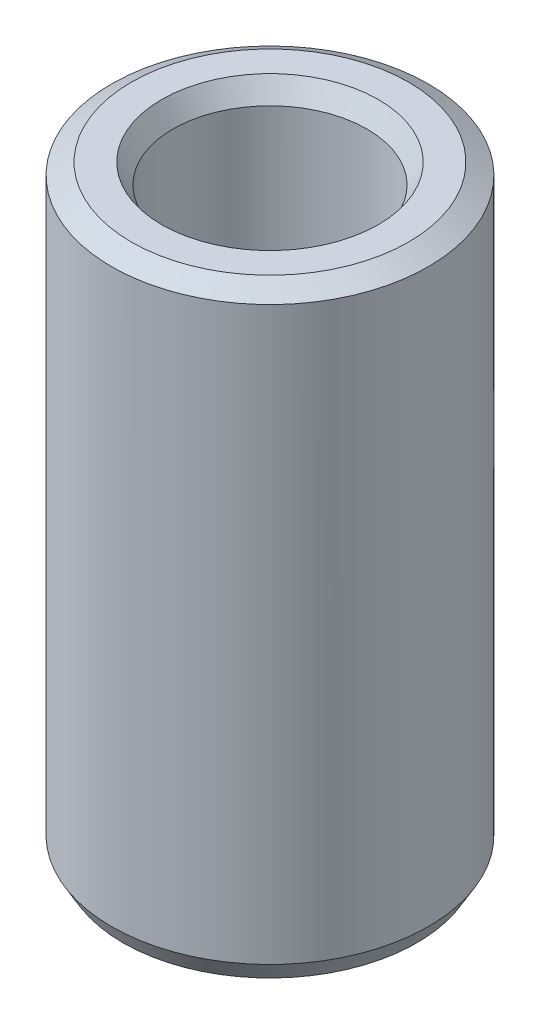
ISO-10303-21;
HEADER;
FILE_DESCRIPTION(('STEP AP214'),'2;1');
FILE_NAME('part.step','',(''),(''),'','','');
FILE_SCHEMA(('AUTOMOTIVE_DESIGN { 1 0 10303 214 1 1 1 1 }'));
ENDSEC;
DATA;
#1=APPLICATION_CONTEXT('core data for automotive mechanical design processes');
#2=APPLICATION_PROTOCOL_DEFINITION('international standard','automotive_design',2000,#1);
#3=PRODUCT_CONTEXT('',#1,'mechanical');
#4=PRODUCT('Part','Part','',(#3));
#5=PRODUCT_RELATED_PRODUCT_CATEGORY('part','',(#4));
#6=PRODUCT_DEFINITION_FORMATION('','',#4);
#7=PRODUCT_DEFINITION_CONTEXT('part definition',#1,'design');
#8=PRODUCT_DEFINITION('design','',#6,#7);
#9=PRODUCT_DEFINITION_SHAPE('','',#8);
#10=(LENGTH_UNIT() NAMED_UNIT(*) SI_UNIT(.MILLI.,.METRE.));
#11=(NAMED_UNIT(*) PLANE_ANGLE_UNIT() SI_UNIT($,.RADIAN.));
#12=(NAMED_UNIT(*) SI_UNIT($,.STERADIAN.) SOLID_ANGLE_UNIT());
#13=UNCERTAINTY_MEASURE_WITH_UNIT(LENGTH_MEASURE(1.E-05),#10,'distance_accuracy_value','');
#14=(GEOMETRIC_REPRESENTATION_CONTEXT(3) GLOBAL_UNCERTAINTY_ASSIGNED_CONTEXT((#13)) GLOBAL_UNIT_ASSIGNED_CONTEXT((#10,
#11,#12)) REPRESENTATION_CONTEXT('',''));
#15=CARTESIAN_POINT('',(0.,0.,0.));
#16=DIRECTION('',(0.,0.,1.));
#17=DIRECTION('',(1.,0.,0.));
#18=AXIS2_PLACEMENT_3D('',#15,#16,#17);
#19=CARTESIAN_POINT('',(0.,133.217558853495,0.));
#20=DIRECTION('',(0.,-1.,0.));
#21=DIRECTION('',(0.,0.,-1.));
#22=AXIS2_PLACEMENT_3D('',#19,#20,#21);
#23=CYLINDRICAL_SURFACE('',#22,35.);
#24=CARTESIAN_POINT('',(0.,4.37569457591963,0.));
#25=DIRECTION('',(0.,1.,0.));
#26=DIRECTION('',(0.,0.,1.));
#27=AXIS2_PLACEMENT_3D('',#24,#25,#26);
#28=CIRCLE('',#27,35.);
#29=CARTESIAN_POINT('',(0.,4.37569457591963,35.));
#30=VERTEX_POINT('',#29);
#31=EDGE_CURVE('E10',#30,#30,#28,.T.);
#32=ORIENTED_EDGE('',*,*,#31,.T.);
#33=EDGE_LOOP('',(#32));
#34=FACE_BOUND('',#33,.T.);
#35=CARTESIAN_POINT('',(0.,130.691250412197,0.));
#36=DIRECTION('',(0.,1.,0.));
#37=DIRECTION('',(0.,0.,1.));
#38=AXIS2_PLACEMENT_3D('',#35,#36,#37);
#39=CIRCLE('',#38,35.);
#40=CARTESIAN_POINT('',(0.,130.691250412197,-35.));
#41=VERTEX_POINT('',#40);
#42=EDGE_CURVE('E50',#41,#41,#39,.F.);
#43=ORIENTED_EDGE('',*,*,#42,.T.);
#44=EDGE_LOOP('',(#43));
#45=FACE_BOUND('',#44,.T.);
#46=ADVANCED_FACE('F39',(#34,#45),#23,.T.);
#47=CARTESIAN_POINT('',(0.,133.217558853495,0.));
#48=DIRECTION('',(0.,1.,0.));
#49=DIRECTION('',(0.,0.,1.));
#50=AXIS2_PLACEMENT_3D('',#47,#48,#49);
#51=PLANE('',#50);
#52=CARTESIAN_POINT('',(0.,133.217558853495,0.));
#53=DIRECTION('',(0.,1.,0.));
#54=DIRECTION('',(0.,0.,1.));
#55=AXIS2_PLACEMENT_3D('',#52,#53,#54);
#56=CIRCLE('',#55,23.9561905738797);
#57=CARTESIAN_POINT('',(0.,133.217558853495,23.9561905738797));
#58=VERTEX_POINT('',#57);
#59=EDGE_CURVE('E58',#58,#58,#56,.F.);
#60=ORIENTED_EDGE('',*,*,#59,.T.);
#61=EDGE_LOOP('',(#60));
#62=FACE_BOUND('',#61,.T.);
#63=CARTESIAN_POINT('',(0.,133.217558853495,0.));
#64=DIRECTION('',(0.,1.,0.));
#65=DIRECTION('',(0.,0.,1.));
#66=AXIS2_PLACEMENT_3D('',#63,#64,#65);
#67=CIRCLE('',#66,30.6243054240803);
#68=CARTESIAN_POINT('',(0.,133.217558853495,-30.6243054240803));
#69=VERTEX_POINT('',#68);
#70=EDGE_CURVE('E61',#69,#69,#67,.T.);
#71=ORIENTED_EDGE('',*,*,#70,.T.);
#72=EDGE_LOOP('',(#71));
#73=FACE_BOUND('',#72,.T.);
#74=ADVANCED_FACE('F88',(#62,#73),#51,.T.);
#75=CARTESIAN_POINT('',(0.,0.,0.));
#76=DIRECTION('',(0.,1.,0.));
#77=DIRECTION('',(0.,0.,1.));
#78=AXIS2_PLACEMENT_3D('',#75,#76,#77);
#79=PLANE('',#78);
#80=CARTESIAN_POINT('',(0.,0.,0.));
#81=DIRECTION('',(0.,1.,0.));
#82=DIRECTION('',(0.,0.,1.));
#83=AXIS2_PLACEMENT_3D('',#80,#81,#82);
#84=CIRCLE('',#83,25.8055767085005);
#85=CARTESIAN_POINT('',(0.,0.,-25.8055767085005));
#86=VERTEX_POINT('',#85);
#87=EDGE_CURVE('E51',#86,#86,#84,.T.);
#88=ORIENTED_EDGE('',*,*,#87,.T.);
#89=EDGE_LOOP('',(#88));
#90=FACE_BOUND('',#89,.T.);
#91=CARTESIAN_POINT('',(0.,0.,0.));
#92=DIRECTION('',(0.,1.,0.));
#93=DIRECTION('',(0.,0.,1.));
#94=AXIS2_PLACEMENT_3D('',#91,#92,#93);
#95=CIRCLE('',#94,32.4736915587012);
#96=CARTESIAN_POINT('',(0.,0.,32.4736915587012));
#97=VERTEX_POINT('',#96);
#98=EDGE_CURVE('E54',#97,#97,#95,.F.);
#99=ORIENTED_EDGE('',*,*,#98,.T.);
#100=EDGE_LOOP('',(#99));
#101=FACE_BOUND('',#100,.T.);
#102=ADVANCED_FACE('F83',(#90,#101),#79,.F.);
#103=CARTESIAN_POINT('',(0.,133.217558853495,0.));
#104=DIRECTION('',(0.,-1.,0.));
#105=DIRECTION('',(0.,0.,-1.));
#106=AXIS2_PLACEMENT_3D('',#103,#104,#105);
#107=CYLINDRICAL_SURFACE('',#106,21.4298821325809);
#108=CARTESIAN_POINT('',(0.,128.841864277576,0.));
#109=DIRECTION('',(0.,1.,0.));
#110=DIRECTION('',(0.,0.,1.));
#111=AXIS2_PLACEMENT_3D('',#108,#109,#110);
#112=CIRCLE('',#111,21.4298821325809);
#113=CARTESIAN_POINT('',(0.,128.841864277576,21.4298821325809));
#114=VERTEX_POINT('',#113);
#115=EDGE_CURVE('E67',#114,#114,#112,.T.);
#116=ORIENTED_EDGE('',*,*,#115,.T.);
#117=EDGE_LOOP('',(#116));
#118=FACE_BOUND('',#117,.T.);
#119=CARTESIAN_POINT('',(0.,2.52630844129884,0.));
#120=DIRECTION('',(0.,1.,0.));
#121=DIRECTION('',(0.,0.,1.));
#122=AXIS2_PLACEMENT_3D('',#119,#120,#121);
#123=CIRCLE('',#122,21.4298821325809);
#124=CARTESIAN_POINT('',(0.,2.52630844129884,-21.4298821325809));
#125=VERTEX_POINT('',#124);
#126=EDGE_CURVE('E69',#125,#125,#123,.F.);
#127=ORIENTED_EDGE('',*,*,#126,.T.);
#128=EDGE_LOOP('',(#127));
#129=FACE_BOUND('',#128,.T.);
#130=ADVANCED_FACE('F71',(#118,#129),#107,.F.);
#131=CARTESIAN_POINT('',(0.,128.841864277576,0.));
#132=DIRECTION('',(0.,1.,0.));
#133=DIRECTION('',(0.,0.,1.));
#134=AXIS2_PLACEMENT_3D('',#131,#132,#133);
#135=CONICAL_SURFACE('',#134,21.4298821325809,0.5235987755983);
#136=ORIENTED_EDGE('',*,*,#59,.F.);
#137=EDGE_LOOP('',(#136));
#138=FACE_BOUND('',#137,.T.);
#139=ORIENTED_EDGE('',*,*,#115,.F.);
#140=EDGE_LOOP('',(#139));
#141=FACE_BOUND('',#140,.T.);
#142=ADVANCED_FACE('F77',(#138,#141),#135,.F.);
#143=CARTESIAN_POINT('',(0.,0.,0.));
#144=DIRECTION('',(0.,-1.,0.));
#145=DIRECTION('',(0.,0.,-1.));
#146=AXIS2_PLACEMENT_3D('',#143,#144,#145);
#147=CONICAL_SURFACE('',#146,25.8055767085005,1.04719755119659);
#148=CARTESIAN_POINT('',(0.,2.52630844129884,-21.4298821325809));
#149=CARTESIAN_POINT('',(0.,2.49999272836864,-21.4754622844134));
#150=CARTESIAN_POINT('',(0.,2.47367701543844,-21.5210424362459));
#151=CARTESIAN_POINT('',(0.,2.42104558957805,-21.6122027399109));
#152=CARTESIAN_POINT('',(0.,2.39472987664785,-21.6577828917434));
#153=CARTESIAN_POINT('',(0.,2.34209845078746,-21.7489431954083));
#154=CARTESIAN_POINT('',(0.,2.31578273785727,-21.7945233472408));
#155=CARTESIAN_POINT('',(0.,2.26315131199687,-21.8856836509058));
#156=CARTESIAN_POINT('',(0.,2.23683559906668,-21.9312638027383));
#157=CARTESIAN_POINT('',(0.,2.18420417320628,-22.0224241064033));
#158=CARTESIAN_POINT('',(0.,2.15788846027609,-22.0680042582358));
#159=CARTESIAN_POINT('',(0.,2.1052570344157,-22.1591645619008));
#160=CARTESIAN_POINT('',(0.,2.0789413214855,-22.2047447137333));
#161=CARTESIAN_POINT('',(0.,2.02630989562511,-22.2959050173983));
#162=CARTESIAN_POINT('',(0.,1.99999418269491,-22.3414851692308));
#163=CARTESIAN_POINT('',(0.,1.94736275683452,-22.4326454728958));
#164=CARTESIAN_POINT('',(0.,1.92104704390432,-22.4782256247283));
#165=CARTESIAN_POINT('',(0.,1.86841561804393,-22.5693859283933));
#166=CARTESIAN_POINT('',(0.,1.84209990511373,-22.6149660802258));
#167=CARTESIAN_POINT('',(0.,1.78946847925334,-22.7061263838908));
#168=CARTESIAN_POINT('',(0.,1.76315276632315,-22.7517065357233));
#169=CARTESIAN_POINT('',(0.,1.71052134046275,-22.8428668393883));
#170=CARTESIAN_POINT('',(0.,1.68420562753256,-22.8884469912208));
#171=CARTESIAN_POINT('',(0.,1.63157420167216,-22.9796072948857));
#172=CARTESIAN_POINT('',(0.,1.60525848874197,-23.0251874467182));
#173=CARTESIAN_POINT('',(0.,1.55262706288158,-23.1163477503832));
#174=CARTESIAN_POINT('',(0.,1.52631134995138,-23.1619279022157));
#175=CARTESIAN_POINT('',(0.,1.47367992409099,-23.2530882058807));
#176=CARTESIAN_POINT('',(0.,1.44736421116079,-23.2986683577132));
#177=CARTESIAN_POINT('',(0.,1.3947327853004,-23.3898286613782));
#178=CARTESIAN_POINT('',(0.,1.3684170723702,-23.4354088132107));
#179=CARTESIAN_POINT('',(0.,1.31578564650981,-23.5265691168757));
#180=CARTESIAN_POINT('',(0.,1.28946993357961,-23.5721492687082));
#181=CARTESIAN_POINT('',(0.,1.23683850771922,-23.6633095723732));
#182=CARTESIAN_POINT('',(0.,1.21052279478902,-23.7088897242057));
#183=CARTESIAN_POINT('',(0.,1.15789136892863,-23.8000500278707));
#184=CARTESIAN_POINT('',(0.,1.13157565599844,-23.8456301797032));
#185=CARTESIAN_POINT('',(0.,1.07894423013804,-23.9367904833682));
#186=CARTESIAN_POINT('',(0.,1.05262851720785,-23.9823706352007));
#187=CARTESIAN_POINT('',(0.,0.999997091347455,-24.0735309388657));
#188=CARTESIAN_POINT('',(0.,0.973681378417259,-24.1191110906982));
#189=CARTESIAN_POINT('',(0.,0.921049952556867,-24.2102713943631));
#190=CARTESIAN_POINT('',(0.,0.894734239626671,-24.2558515461956));
#191=CARTESIAN_POINT('',(0.,0.842102813766279,-24.3470118498606));
#192=CARTESIAN_POINT('',(0.,0.815787100836082,-24.3925920016931));
#193=CARTESIAN_POINT('',(0.,0.76315567497569,-24.4837523053581));
#194=CARTESIAN_POINT('',(0.,0.736839962045494,-24.5293324571906));
#195=CARTESIAN_POINT('',(0.,0.684208536185101,-24.6204927608556));
#196=CARTESIAN_POINT('',(0.,0.657892823254905,-24.6660729126881));
#197=CARTESIAN_POINT('',(0.,0.605261397394513,-24.7572332163531));
#198=CARTESIAN_POINT('',(0.,0.578945684464316,-24.8028133681856));
#199=CARTESIAN_POINT('',(0.,0.526314258603924,-24.8939736718506));
#200=CARTESIAN_POINT('',(0.,0.499998545673728,-24.9395538236831));
#201=CARTESIAN_POINT('',(0.,0.447367119813336,-25.0307141273481));
#202=CARTESIAN_POINT('',(0.,0.42105140688314,-25.0762942791806));
#203=CARTESIAN_POINT('',(0.,0.368419981022747,-25.1674545828456));
#204=CARTESIAN_POINT('',(0.,0.34210426809255,-25.2130347346781));
#205=CARTESIAN_POINT('',(0.,0.289472842232158,-25.3041950383431));
#206=CARTESIAN_POINT('',(0.,0.263157129301962,-25.3497751901756));
#207=CARTESIAN_POINT('',(0.,0.21052570344157,-25.4409354938405));
#208=CARTESIAN_POINT('',(0.,0.184209990511374,-25.486515645673));
#209=CARTESIAN_POINT('',(0.,0.131578564650981,-25.577675949338));
#210=CARTESIAN_POINT('',(0.,0.105262851720785,-25.6232561011705));
#211=CARTESIAN_POINT('',(0.,0.0526314258603919,-25.7144164048355));
#212=CARTESIAN_POINT('',(0.,0.0263157129301955,-25.759996556668));
#213=CARTESIAN_POINT('',(0.,0.,-25.8055767085005));
#214=B_SPLINE_CURVE_WITH_KNOTS('',3,(#148,#149,#150,#151,#152,#153,#154,#155,#156,#157,#158,
#159,#160,#161,#162,#163,#164,#165,#166,#167,#168,#169,#170,#171,#172,#173,#174,#175,#176,#177,
#178,#179,#180,#181,#182,#183,#184,#185,#186,#187,#188,#189,#190,#191,#192,#193,#194,#195,#196,
#197,#198,#199,#200,#201,#202,#203,#204,#205,#206,#207,#208,#209,#210,#211,#212,#213),
.UNSPECIFIED.,.F.,.F.,(4,2,2,2,2,2,2,2,2,2,2,2,2,2,2,2,2,2,2,2,2,2,2,2,2,2,2,2,2,2,2,2,4),(0.,
0.157894277581176,0.31578855516235,0.473682832743526,0.631577110324702,0.789471387905876,
0.947365665487052,1.10525994306823,1.2631542206494,1.42104849823058,1.57894277581175,
1.73683705339293,1.8947313309741,2.05262560855528,2.21051988613645,2.36841416371763,
2.52630844129881,2.68420271887998,2.84209699646116,2.99999127404233,3.15788555162351,
3.31577982920468,3.47367410678586,3.63156838436703,3.78946266194821,3.94735693952938,
4.10525121711056,4.26314549469173,4.42103977227291,4.57893404985408,4.73682832743526,
4.89472260501643,5.05261688259761),.UNSPECIFIED.);
#215=EDGE_CURVE('BSEAM73',#125,#86,#214,.T.);
#216=ORIENTED_EDGE('',*,*,#126,.F.);
#217=ORIENTED_EDGE('',*,*,#87,.F.);
#218=ORIENTED_EDGE('',*,*,#215,.T.);
#219=ORIENTED_EDGE('',*,*,#215,.F.);
#220=EDGE_LOOP('',(#216,#218,#217,#219));
#221=FACE_BOUND('',#220,.T.);
#222=ADVANCED_FACE('F73',(#221),#147,.F.);
#223=CARTESIAN_POINT('',(0.,4.37569457591963,0.));
#224=DIRECTION('',(0.,1.,0.));
#225=DIRECTION('',(0.,0.,1.));
#226=AXIS2_PLACEMENT_3D('',#223,#224,#225);
#227=CONICAL_SURFACE('',#226,35.,0.523598775598299);
#228=ORIENTED_EDGE('',*,*,#98,.F.);
#229=EDGE_LOOP('',(#228));
#230=FACE_BOUND('',#229,.T.);
#231=ORIENTED_EDGE('',*,*,#31,.F.);
#232=EDGE_LOOP('',(#231));
#233=FACE_BOUND('',#232,.T.);
#234=ADVANCED_FACE('F76',(#230,#233),#227,.T.);
#235=CARTESIAN_POINT('',(0.,133.217558853495,0.));
#236=DIRECTION('',(0.,-1.,0.));
#237=DIRECTION('',(0.,0.,-1.));
#238=AXIS2_PLACEMENT_3D('',#235,#236,#237);
#239=CONICAL_SURFACE('',#238,30.6243054240803,1.0471975511966);
#240=CARTESIAN_POINT('',(0.,130.691250412197,-35.));
#241=CARTESIAN_POINT('',(0.,130.717566125127,-34.9544198481675));
#242=CARTESIAN_POINT('',(0.,130.743881838057,-34.908839696335));
#243=CARTESIAN_POINT('',(0.,130.796513263917,-34.81767939267));
#244=CARTESIAN_POINT('',(0.,130.822828976848,-34.7720992408376));
#245=CARTESIAN_POINT('',(0.,130.875460402708,-34.6809389371726));
#246=CARTESIAN_POINT('',(0.,130.901776115638,-34.6353587853401));
#247=CARTESIAN_POINT('',(0.,130.954407541499,-34.5441984816751));
#248=CARTESIAN_POINT('',(0.,130.980723254429,-34.4986183298426));
#249=CARTESIAN_POINT('',(0.,131.033354680289,-34.4074580261776));
#250=CARTESIAN_POINT('',(0.,131.059670393219,-34.3618778743451));
#251=CARTESIAN_POINT('',(0.,131.11230181908,-34.2707175706801));
#252=CARTESIAN_POINT('',(0.,131.13861753201,-34.2251374188476));
#253=CARTESIAN_POINT('',(0.,131.19124895787,-34.1339771151826));
#254=CARTESIAN_POINT('',(0.,131.217564670801,-34.0883969633501));
#255=CARTESIAN_POINT('',(0.,131.270196096661,-33.9972366596851));
#256=CARTESIAN_POINT('',(0.,131.296511809591,-33.9516565078526));
#257=CARTESIAN_POINT('',(0.,131.349143235451,-33.8604962041876));
#258=CARTESIAN_POINT('',(0.,131.375458948382,-33.8149160523551));
#259=CARTESIAN_POINT('',(0.,131.428090374242,-33.7237557486901));
#260=CARTESIAN_POINT('',(0.,131.454406087172,-33.6781755968576));
#261=CARTESIAN_POINT('',(0.,131.507037513033,-33.5870152931926));
#262=CARTESIAN_POINT('',(0.,131.533353225963,-33.5414351413601));
#263=CARTESIAN_POINT('',(0.,131.585984651823,-33.4502748376951));
#264=CARTESIAN_POINT('',(0.,131.612300364753,-33.4046946858626));
#265=CARTESIAN_POINT('',(0.,131.664931790614,-33.3135343821977));
#266=CARTESIAN_POINT('',(0.,131.691247503544,-33.2679542303652));
#267=CARTESIAN_POINT('',(0.,131.743878929404,-33.1767939267002));
#268=CARTESIAN_POINT('',(0.,131.770194642335,-33.1312137748677));
#269=CARTESIAN_POINT('',(0.,131.822826068195,-33.0400534712027));
#270=CARTESIAN_POINT('',(0.,131.849141781125,-32.9944733193702));
#271=CARTESIAN_POINT('',(0.,131.901773206986,-32.9033130157052));
#272=CARTESIAN_POINT('',(0.,131.928088919916,-32.8577328638727));
#273=CARTESIAN_POINT('',(0.,131.980720345776,-32.7665725602077));
#274=CARTESIAN_POINT('',(0.,132.007036058706,-32.7209924083752));
#275=CARTESIAN_POINT('',(0.,132.059667484567,-32.6298321047102));
#276=CARTESIAN_POINT('',(0.,132.085983197497,-32.5842519528777));
#277=CARTESIAN_POINT('',(0.,132.138614623357,-32.4930916492127));
#278=CARTESIAN_POINT('',(0.,132.164930336288,-32.4475114973802));
#279=CARTESIAN_POINT('',(0.,132.217561762148,-32.3563511937152));
#280=CARTESIAN_POINT('',(0.,132.243877475078,-32.3107710418827));
#281=CARTESIAN_POINT('',(0.,132.296508900939,-32.2196107382177));
#282=CARTESIAN_POINT('',(0.,132.322824613869,-32.1740305863852));
#283=CARTESIAN_POINT('',(0.,132.375456039729,-32.0828702827202));
#284=CARTESIAN_POINT('',(0.,132.401771752659,-32.0372901308877));
#285=CARTESIAN_POINT('',(0.,132.45440317852,-31.9461298272228));
#286=CARTESIAN_POINT('',(0.,132.48071889145,-31.9005496753903));
#287=CARTESIAN_POINT('',(0.,132.53335031731,-31.8093893717253));
#288=CARTESIAN_POINT('',(0.,132.559666030241,-31.7638092198928));
#289=CARTESIAN_POINT('',(0.,132.612297456101,-31.6726489162278));
#290=CARTESIAN_POINT('',(0.,132.638613169031,-31.6270687643953));
#291=CARTESIAN_POINT('',(0.,132.691244594892,-31.5359084607303));
#292=CARTESIAN_POINT('',(0.,132.717560307822,-31.4903283088978));
#293=CARTESIAN_POINT('',(0.,132.770191733682,-31.3991680052328));
#294=CARTESIAN_POINT('',(0.,132.796507446612,-31.3535878534003));
#295=CARTESIAN_POINT('',(0.,132.849138872473,-31.2624275497353));
#296=CARTESIAN_POINT('',(0.,132.875454585403,-31.2168473979028));
#297=CARTESIAN_POINT('',(0.,132.928086011263,-31.1256870942378));
#298=CARTESIAN_POINT('',(0.,132.954401724193,-31.0801069424053));
#299=CARTESIAN_POINT('',(0.,133.007033150054,-30.9889466387403));
#300=CARTESIAN_POINT('',(0.,133.033348862984,-30.9433664869078));
#301=CARTESIAN_POINT('',(0.,133.085980288844,-30.8522061832428));
#302=CARTESIAN_POINT('',(0.,133.112296001775,-30.8066260314103));
#303=CARTESIAN_POINT('',(0.,133.164927427635,-30.7154657277453));
#304=CARTESIAN_POINT('',(0.,133.191243140565,-30.6698855759128));
#305=CARTESIAN_POINT('',(0.,133.217558853495,-30.6243054240803));
#306=B_SPLINE_CURVE_WITH_KNOTS('',3,(#240,#241,#242,#243,#244,#245,#246,#247,#248,#249,#250,
#251,#252,#253,#254,#255,#256,#257,#258,#259,#260,#261,#262,#263,#264,#265,#266,#267,#268,#269,
#270,#271,#272,#273,#274,#275,#276,#277,#278,#279,#280,#281,#282,#283,#284,#285,#286,#287,#288,
#289,#290,#291,#292,#293,#294,#295,#296,#297,#298,#299,#300,#301,#302,#303,#304,#305),
.UNSPECIFIED.,.F.,.F.,(4,2,2,2,2,2,2,2,2,2,2,2,2,2,2,2,2,2,2,2,2,2,2,2,2,2,2,2,2,2,2,2,4),(0.,
0.157894277581169,0.31578855516235,0.473682832743525,0.6315771103247,0.789471387905875,
0.94736566548705,1.10525994306823,1.2631542206494,1.42104849823058,1.57894277581175,
1.73683705339294,1.89473133097411,2.05262560855529,2.21051988613646,2.36841416371764,
2.52630844129881,2.68420271887999,2.84209699646116,2.99999127404234,3.15788555162351,
3.31577982920469,3.47367410678588,3.63156838436705,3.78946266194823,3.9473569395294,
4.10525121711058,4.26314549469175,4.42103977227293,4.57893404985411,4.73682832743528,
4.89472260501646,5.05261688259764),.UNSPECIFIED.);
#307=EDGE_CURVE('BSEAM45',#41,#69,#306,.T.);
#308=ORIENTED_EDGE('',*,*,#42,.F.);
#309=ORIENTED_EDGE('',*,*,#70,.F.);
#310=ORIENTED_EDGE('',*,*,#307,.T.);
#311=ORIENTED_EDGE('',*,*,#307,.F.);
#312=EDGE_LOOP('',(#308,#310,#309,#311));
#313=FACE_BOUND('',#312,.T.);
#314=ADVANCED_FACE('F45',(#313),#239,.T.);
#315=CLOSED_SHELL('',(#46,#74,#102,#130,#142,#222,#234,#314));
#316=MANIFOLD_SOLID_BREP('B2',#315);
#317=ADVANCED_BREP_SHAPE_REPRESENTATION('',(#18,#316),#14);
#318=SHAPE_DEFINITION_REPRESENTATION(#9,#317);
ENDSEC;
END-ISO-10303-21;
